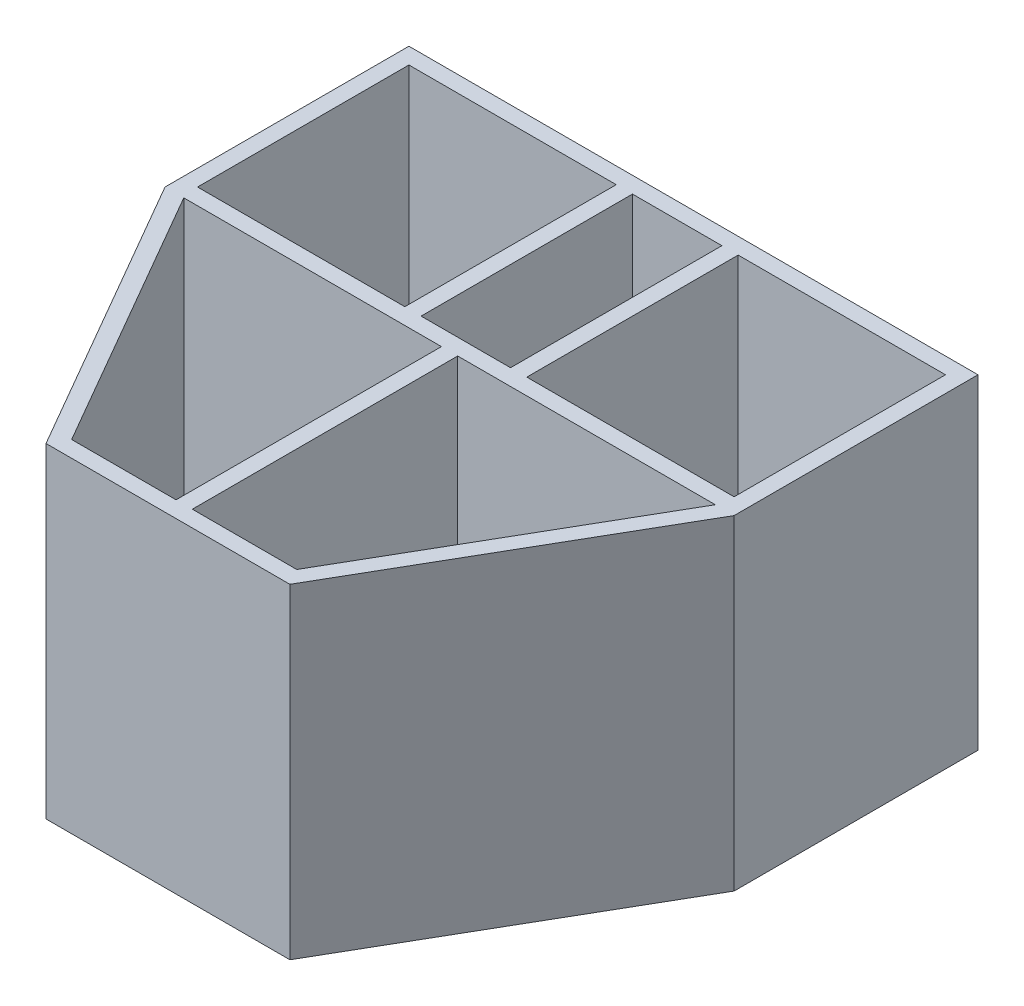
ISO-10303-21;
HEADER;
FILE_DESCRIPTION(('STEP AP214'),'2;1');
FILE_NAME('part.step','',(''),(''),'','','');
FILE_SCHEMA(('AUTOMOTIVE_DESIGN { 1 0 10303 214 1 1 1 1 }'));
ENDSEC;
DATA;
#1=APPLICATION_CONTEXT('core data for automotive mechanical design processes');
#2=APPLICATION_PROTOCOL_DEFINITION('international standard','automotive_design',2000,#1);
#3=PRODUCT_CONTEXT('',#1,'mechanical');
#4=PRODUCT('Part','Part','',(#3));
#5=PRODUCT_RELATED_PRODUCT_CATEGORY('part','',(#4));
#6=PRODUCT_DEFINITION_FORMATION('','',#4);
#7=PRODUCT_DEFINITION_CONTEXT('part definition',#1,'design');
#8=PRODUCT_DEFINITION('design','',#6,#7);
#9=PRODUCT_DEFINITION_SHAPE('','',#8);
#10=(LENGTH_UNIT() NAMED_UNIT(*) SI_UNIT(.MILLI.,.METRE.));
#11=(NAMED_UNIT(*) PLANE_ANGLE_UNIT() SI_UNIT($,.RADIAN.));
#12=(NAMED_UNIT(*) SI_UNIT($,.STERADIAN.) SOLID_ANGLE_UNIT());
#13=UNCERTAINTY_MEASURE_WITH_UNIT(LENGTH_MEASURE(1.E-05),#10,'distance_accuracy_value','');
#14=(GEOMETRIC_REPRESENTATION_CONTEXT(3) GLOBAL_UNCERTAINTY_ASSIGNED_CONTEXT((#13)) GLOBAL_UNIT_ASSIGNED_CONTEXT((#10,
#11,#12)) REPRESENTATION_CONTEXT('',''));
#15=CARTESIAN_POINT('',(0.,0.,0.));
#16=DIRECTION('',(0.,0.,1.));
#17=DIRECTION('',(1.,0.,0.));
#18=AXIS2_PLACEMENT_3D('',#15,#16,#17);
#19=CARTESIAN_POINT('',(0.,20.,0.));
#20=DIRECTION('',(0.,-1.,0.));
#21=DIRECTION('',(0.,0.,-1.));
#22=AXIS2_PLACEMENT_3D('',#19,#20,#21);
#23=PLANE('',#22);
#24=DIRECTION('',(-1.,0.,0.));
#25=VECTOR('',#24,1.);
#26=CARTESIAN_POINT('',(16.3452994616207,20.,0.));
#27=LINE('',#26,#25);
#28=CARTESIAN_POINT('',(16.3452994616207,20.,0.));
#29=VERTEX_POINT('',#28);
#30=CARTESIAN_POINT('',(0.500000000000004,20.,0.));
#31=VERTEX_POINT('',#30);
#32=EDGE_CURVE('E241',#29,#31,#27,.T.);
#33=ORIENTED_EDGE('',*,*,#32,.F.);
#34=DIRECTION('',(0.499999999999998,0.,-0.86602540378444));
#35=VECTOR('',#34,1.);
#36=CARTESIAN_POINT('',(6.92264973081037,20.,16.3205080756889));
#37=LINE('',#36,#35);
#38=CARTESIAN_POINT('',(6.92264973081037,20.,16.3205080756889));
#39=VERTEX_POINT('',#38);
#40=EDGE_CURVE('E249',#39,#29,#37,.T.);
#41=ORIENTED_EDGE('',*,*,#40,.F.);
#42=DIRECTION('',(1.,0.,0.));
#43=VECTOR('',#42,1.);
#44=CARTESIAN_POINT('',(0.500000000000006,20.,16.3205080756889));
#45=LINE('',#44,#43);
#46=CARTESIAN_POINT('',(0.500000000000006,20.,16.3205080756889));
#47=VERTEX_POINT('',#46);
#48=EDGE_CURVE('E246',#47,#39,#45,.T.);
#49=ORIENTED_EDGE('',*,*,#48,.F.);
#50=DIRECTION('',(0.,0.,1.));
#51=VECTOR('',#50,1.);
#52=CARTESIAN_POINT('',(0.500000000000004,20.,0.));
#53=LINE('',#52,#51);
#54=EDGE_CURVE('E243',#31,#47,#53,.T.);
#55=ORIENTED_EDGE('',*,*,#54,.F.);
#56=EDGE_LOOP('',(#33,#41,#49,#55));
#57=FACE_BOUND('',#56,.T.);
#58=DIRECTION('',(1.,0.,0.));
#59=VECTOR('',#58,1.);
#60=CARTESIAN_POINT('',(3.75,20.,-0.999999999999992));
#61=LINE('',#60,#59);
#62=CARTESIAN_POINT('',(3.75,20.,-0.999999999999992));
#63=VERTEX_POINT('',#62);
#64=CARTESIAN_POINT('',(16.5,20.,-0.999999999999992));
#65=VERTEX_POINT('',#64);
#66=EDGE_CURVE('E303',#63,#65,#61,.T.);
#67=ORIENTED_EDGE('',*,*,#66,.F.);
#68=DIRECTION('',(0.,0.,1.));
#69=VECTOR('',#68,1.);
#70=CARTESIAN_POINT('',(3.75,20.,-14.));
#71=LINE('',#70,#69);
#72=CARTESIAN_POINT('',(3.75,20.,-14.));
#73=VERTEX_POINT('',#72);
#74=EDGE_CURVE('E311',#73,#63,#71,.T.);
#75=ORIENTED_EDGE('',*,*,#74,.F.);
#76=DIRECTION('',(-1.,0.,0.));
#77=VECTOR('',#76,1.);
#78=CARTESIAN_POINT('',(3.75,20.,-14.));
#79=LINE('',#78,#77);
#80=CARTESIAN_POINT('',(16.5,20.,-14.));
#81=VERTEX_POINT('',#80);
#82=EDGE_CURVE('E308',#81,#73,#79,.T.);
#83=ORIENTED_EDGE('',*,*,#82,.F.);
#84=DIRECTION('',(0.,0.,-1.));
#85=VECTOR('',#84,1.);
#86=CARTESIAN_POINT('',(16.5,20.,-14.));
#87=LINE('',#86,#85);
#88=EDGE_CURVE('E305',#65,#81,#87,.T.);
#89=ORIENTED_EDGE('',*,*,#88,.F.);
#90=EDGE_LOOP('',(#67,#75,#83,#89));
#91=FACE_BOUND('',#90,.T.);
#92=DIRECTION('',(0.,0.,1.));
#93=VECTOR('',#92,1.);
#94=CARTESIAN_POINT('',(-17.5,20.,0.));
#95=LINE('',#94,#93);
#96=CARTESIAN_POINT('',(-17.5,20.,-15.));
#97=VERTEX_POINT('',#96);
#98=CARTESIAN_POINT('',(-17.5,20.,0.));
#99=VERTEX_POINT('',#98);
#100=EDGE_CURVE('E365',#97,#99,#95,.T.);
#101=ORIENTED_EDGE('',*,*,#100,.T.);
#102=DIRECTION('',(0.499999999999998,0.,0.86602540378444));
#103=VECTOR('',#102,1.);
#104=CARTESIAN_POINT('',(-7.49999999999999,20.,17.3205080756889));
#105=LINE('',#104,#103);
#106=CARTESIAN_POINT('',(-7.49999999999999,20.,17.3205080756889));
#107=VERTEX_POINT('',#106);
#108=EDGE_CURVE('E368',#99,#107,#105,.T.);
#109=ORIENTED_EDGE('',*,*,#108,.T.);
#110=DIRECTION('',(1.,0.,0.));
#111=VECTOR('',#110,1.);
#112=CARTESIAN_POINT('',(7.50000000000001,20.,17.3205080756889));
#113=LINE('',#112,#111);
#114=CARTESIAN_POINT('',(7.50000000000001,20.,17.3205080756889));
#115=VERTEX_POINT('',#114);
#116=EDGE_CURVE('E371',#107,#115,#113,.T.);
#117=ORIENTED_EDGE('',*,*,#116,.T.);
#118=DIRECTION('',(0.499999999999998,0.,-0.86602540378444));
#119=VECTOR('',#118,1.);
#120=CARTESIAN_POINT('',(17.5,20.,0.));
#121=LINE('',#120,#119);
#122=CARTESIAN_POINT('',(17.5,20.,0.));
#123=VERTEX_POINT('',#122);
#124=EDGE_CURVE('E373',#115,#123,#121,.T.);
#125=ORIENTED_EDGE('',*,*,#124,.T.);
#126=DIRECTION('',(0.,0.,-1.));
#127=VECTOR('',#126,1.);
#128=CARTESIAN_POINT('',(17.5,20.,-15.));
#129=LINE('',#128,#127);
#130=CARTESIAN_POINT('',(17.5,20.,-15.));
#131=VERTEX_POINT('',#130);
#132=EDGE_CURVE('E375',#123,#131,#129,.T.);
#133=ORIENTED_EDGE('',*,*,#132,.T.);
#134=DIRECTION('',(-1.,0.,0.));
#135=VECTOR('',#134,1.);
#136=CARTESIAN_POINT('',(-17.5,20.,-15.));
#137=LINE('',#136,#135);
#138=EDGE_CURVE('E377',#131,#97,#137,.T.);
#139=ORIENTED_EDGE('',*,*,#138,.T.);
#140=EDGE_LOOP('',(#101,#109,#117,#125,#133,#139));
#141=FACE_BOUND('',#140,.T.);
#142=DIRECTION('',(0.,0.,1.));
#143=VECTOR('',#142,1.);
#144=CARTESIAN_POINT('',(-16.5,20.,-14.));
#145=LINE('',#144,#143);
#146=CARTESIAN_POINT('',(-16.5,20.,-14.));
#147=VERTEX_POINT('',#146);
#148=CARTESIAN_POINT('',(-16.5,20.,-0.999999999999992));
#149=VERTEX_POINT('',#148);
#150=EDGE_CURVE('E334',#147,#149,#145,.T.);
#151=ORIENTED_EDGE('',*,*,#150,.F.);
#152=DIRECTION('',(-1.,0.,0.));
#153=VECTOR('',#152,1.);
#154=CARTESIAN_POINT('',(-16.5,20.,-14.));
#155=LINE('',#154,#153);
#156=CARTESIAN_POINT('',(-3.75,20.,-14.));
#157=VERTEX_POINT('',#156);
#158=EDGE_CURVE('E342',#157,#147,#155,.T.);
#159=ORIENTED_EDGE('',*,*,#158,.F.);
#160=DIRECTION('',(0.,0.,-1.));
#161=VECTOR('',#160,1.);
#162=CARTESIAN_POINT('',(-3.75,20.,-14.));
#163=LINE('',#162,#161);
#164=CARTESIAN_POINT('',(-3.75,20.,-0.999999999999992));
#165=VERTEX_POINT('',#164);
#166=EDGE_CURVE('E339',#165,#157,#163,.T.);
#167=ORIENTED_EDGE('',*,*,#166,.F.);
#168=DIRECTION('',(1.,0.,0.));
#169=VECTOR('',#168,1.);
#170=CARTESIAN_POINT('',(-16.5,20.,-0.999999999999992));
#171=LINE('',#170,#169);
#172=EDGE_CURVE('E336',#149,#165,#171,.T.);
#173=ORIENTED_EDGE('',*,*,#172,.F.);
#174=EDGE_LOOP('',(#151,#159,#167,#173));
#175=FACE_BOUND('',#174,.T.);
#176=DIRECTION('',(-1.,0.,0.));
#177=VECTOR('',#176,1.);
#178=CARTESIAN_POINT('',(-0.499999999999997,20.,0.));
#179=LINE('',#178,#177);
#180=CARTESIAN_POINT('',(-0.499999999999997,20.,0.));
#181=VERTEX_POINT('',#180);
#182=CARTESIAN_POINT('',(-16.3452994616207,20.,0.));
#183=VERTEX_POINT('',#182);
#184=EDGE_CURVE('E272',#181,#183,#179,.T.);
#185=ORIENTED_EDGE('',*,*,#184,.F.);
#186=DIRECTION('',(0.,0.,-1.));
#187=VECTOR('',#186,1.);
#188=CARTESIAN_POINT('',(-0.499999999999994,20.,16.3205080756889));
#189=LINE('',#188,#187);
#190=CARTESIAN_POINT('',(-0.499999999999994,20.,16.3205080756889));
#191=VERTEX_POINT('',#190);
#192=EDGE_CURVE('E280',#191,#181,#189,.T.);
#193=ORIENTED_EDGE('',*,*,#192,.F.);
#194=DIRECTION('',(1.,0.,0.));
#195=VECTOR('',#194,1.);
#196=CARTESIAN_POINT('',(-6.92264973081036,20.,16.3205080756889));
#197=LINE('',#196,#195);
#198=CARTESIAN_POINT('',(-6.92264973081036,20.,16.3205080756889));
#199=VERTEX_POINT('',#198);
#200=EDGE_CURVE('E277',#199,#191,#197,.T.);
#201=ORIENTED_EDGE('',*,*,#200,.F.);
#202=DIRECTION('',(0.499999999999998,0.,0.86602540378444));
#203=VECTOR('',#202,1.);
#204=CARTESIAN_POINT('',(-16.3452994616207,20.,0.));
#205=LINE('',#204,#203);
#206=EDGE_CURVE('E274',#183,#199,#205,.T.);
#207=ORIENTED_EDGE('',*,*,#206,.F.);
#208=EDGE_LOOP('',(#185,#193,#201,#207));
#209=FACE_BOUND('',#208,.T.);
#210=DIRECTION('',(-1.,0.,0.));
#211=VECTOR('',#210,1.);
#212=CARTESIAN_POINT('',(-2.75,20.,-14.));
#213=LINE('',#212,#211);
#214=CARTESIAN_POINT('',(2.75,20.,-14.));
#215=VERTEX_POINT('',#214);
#216=CARTESIAN_POINT('',(-2.75,20.,-14.));
#217=VERTEX_POINT('',#216);
#218=EDGE_CURVE('E205',#215,#217,#213,.T.);
#219=ORIENTED_EDGE('',*,*,#218,.F.);
#220=DIRECTION('',(0.,0.,-1.));
#221=VECTOR('',#220,1.);
#222=CARTESIAN_POINT('',(2.75,20.,-14.));
#223=LINE('',#222,#221);
#224=CARTESIAN_POINT('',(2.75,20.,-0.999999999999993));
#225=VERTEX_POINT('',#224);
#226=EDGE_CURVE('E227',#225,#215,#223,.T.);
#227=ORIENTED_EDGE('',*,*,#226,.F.);
#228=DIRECTION('',(1.,0.,0.));
#229=VECTOR('',#228,1.);
#230=CARTESIAN_POINT('',(-2.75,20.,-0.999999999999992));
#231=LINE('',#230,#229);
#232=CARTESIAN_POINT('',(-2.75,20.,-0.999999999999992));
#233=VERTEX_POINT('',#232);
#234=EDGE_CURVE('E225',#233,#225,#231,.T.);
#235=ORIENTED_EDGE('',*,*,#234,.F.);
#236=DIRECTION('',(0.,0.,1.));
#237=VECTOR('',#236,1.);
#238=CARTESIAN_POINT('',(-2.75,20.,-14.));
#239=LINE('',#238,#237);
#240=EDGE_CURVE('E213',#217,#233,#239,.T.);
#241=ORIENTED_EDGE('',*,*,#240,.F.);
#242=EDGE_LOOP('',(#219,#227,#235,#241));
#243=FACE_BOUND('',#242,.T.);
#244=ADVANCED_FACE('F32',(#57,#91,#141,#175,#209,#243),#23,.F.);
#245=CARTESIAN_POINT('',(0.,0.,0.));
#246=DIRECTION('',(0.,-1.,0.));
#247=DIRECTION('',(0.,0.,-1.));
#248=AXIS2_PLACEMENT_3D('',#245,#246,#247);
#249=PLANE('',#248);
#250=DIRECTION('',(0.499999999999998,0.,-0.86602540378444));
#251=VECTOR('',#250,1.);
#252=CARTESIAN_POINT('',(6.92264973081037,0.,16.3205080756889));
#253=LINE('',#252,#251);
#254=CARTESIAN_POINT('',(6.92264973081037,0.,16.3205080756889));
#255=VERTEX_POINT('',#254);
#256=CARTESIAN_POINT('',(16.3452994616207,0.,0.));
#257=VERTEX_POINT('',#256);
#258=EDGE_CURVE('E244',#255,#257,#253,.T.);
#259=ORIENTED_EDGE('',*,*,#258,.T.);
#260=DIRECTION('',(-1.,0.,0.));
#261=VECTOR('',#260,1.);
#262=CARTESIAN_POINT('',(16.3452994616207,0.,0.));
#263=LINE('',#262,#261);
#264=CARTESIAN_POINT('',(0.500000000000004,0.,0.));
#265=VERTEX_POINT('',#264);
#266=EDGE_CURVE('E221',#257,#265,#263,.T.);
#267=ORIENTED_EDGE('',*,*,#266,.T.);
#268=DIRECTION('',(0.,0.,1.));
#269=VECTOR('',#268,1.);
#270=CARTESIAN_POINT('',(0.500000000000004,0.,0.));
#271=LINE('',#270,#269);
#272=CARTESIAN_POINT('',(0.500000000000006,0.,16.3205080756889));
#273=VERTEX_POINT('',#272);
#274=EDGE_CURVE('E254',#265,#273,#271,.T.);
#275=ORIENTED_EDGE('',*,*,#274,.T.);
#276=DIRECTION('',(1.,0.,0.));
#277=VECTOR('',#276,1.);
#278=CARTESIAN_POINT('',(0.500000000000006,0.,16.3205080756889));
#279=LINE('',#278,#277);
#280=EDGE_CURVE('E257',#273,#255,#279,.T.);
#281=ORIENTED_EDGE('',*,*,#280,.T.);
#282=EDGE_LOOP('',(#259,#267,#275,#281));
#283=FACE_BOUND('',#282,.T.);
#284=DIRECTION('',(0.,0.,1.));
#285=VECTOR('',#284,1.);
#286=CARTESIAN_POINT('',(3.75,0.,-14.));
#287=LINE('',#286,#285);
#288=CARTESIAN_POINT('',(3.75,0.,-14.));
#289=VERTEX_POINT('',#288);
#290=CARTESIAN_POINT('',(3.75,0.,-0.999999999999992));
#291=VERTEX_POINT('',#290);
#292=EDGE_CURVE('E306',#289,#291,#287,.T.);
#293=ORIENTED_EDGE('',*,*,#292,.T.);
#294=DIRECTION('',(1.,0.,0.));
#295=VECTOR('',#294,1.);
#296=CARTESIAN_POINT('',(3.75,0.,-0.999999999999992));
#297=LINE('',#296,#295);
#298=CARTESIAN_POINT('',(16.5,0.,-0.999999999999992));
#299=VERTEX_POINT('',#298);
#300=EDGE_CURVE('E302',#291,#299,#297,.T.);
#301=ORIENTED_EDGE('',*,*,#300,.T.);
#302=DIRECTION('',(0.,0.,-1.));
#303=VECTOR('',#302,1.);
#304=CARTESIAN_POINT('',(16.5,0.,-14.));
#305=LINE('',#304,#303);
#306=CARTESIAN_POINT('',(16.5,0.,-14.));
#307=VERTEX_POINT('',#306);
#308=EDGE_CURVE('E316',#299,#307,#305,.T.);
#309=ORIENTED_EDGE('',*,*,#308,.T.);
#310=DIRECTION('',(-1.,0.,0.));
#311=VECTOR('',#310,1.);
#312=CARTESIAN_POINT('',(3.75,0.,-14.));
#313=LINE('',#312,#311);
#314=EDGE_CURVE('E319',#307,#289,#313,.T.);
#315=ORIENTED_EDGE('',*,*,#314,.T.);
#316=EDGE_LOOP('',(#293,#301,#309,#315));
#317=FACE_BOUND('',#316,.T.);
#318=DIRECTION('',(0.,0.,1.));
#319=VECTOR('',#318,1.);
#320=CARTESIAN_POINT('',(-17.5,0.,0.));
#321=LINE('',#320,#319);
#322=CARTESIAN_POINT('',(-17.5,0.,-15.));
#323=VERTEX_POINT('',#322);
#324=CARTESIAN_POINT('',(-17.5,0.,0.));
#325=VERTEX_POINT('',#324);
#326=EDGE_CURVE('E364',#323,#325,#321,.T.);
#327=ORIENTED_EDGE('',*,*,#326,.F.);
#328=DIRECTION('',(-1.,0.,0.));
#329=VECTOR('',#328,1.);
#330=CARTESIAN_POINT('',(-17.5,0.,-15.));
#331=LINE('',#330,#329);
#332=CARTESIAN_POINT('',(17.5,0.,-15.));
#333=VERTEX_POINT('',#332);
#334=EDGE_CURVE('E369',#333,#323,#331,.T.);
#335=ORIENTED_EDGE('',*,*,#334,.F.);
#336=DIRECTION('',(0.,0.,-1.));
#337=VECTOR('',#336,1.);
#338=CARTESIAN_POINT('',(17.5,0.,-15.));
#339=LINE('',#338,#337);
#340=CARTESIAN_POINT('',(17.5,0.,0.));
#341=VERTEX_POINT('',#340);
#342=EDGE_CURVE('E388',#341,#333,#339,.T.);
#343=ORIENTED_EDGE('',*,*,#342,.F.);
#344=DIRECTION('',(0.499999999999998,0.,-0.86602540378444));
#345=VECTOR('',#344,1.);
#346=CARTESIAN_POINT('',(17.5,0.,0.));
#347=LINE('',#346,#345);
#348=CARTESIAN_POINT('',(7.50000000000001,0.,17.3205080756889));
#349=VERTEX_POINT('',#348);
#350=EDGE_CURVE('E386',#349,#341,#347,.T.);
#351=ORIENTED_EDGE('',*,*,#350,.F.);
#352=DIRECTION('',(1.,0.,0.));
#353=VECTOR('',#352,1.);
#354=CARTESIAN_POINT('',(7.50000000000001,0.,17.3205080756889));
#355=LINE('',#354,#353);
#356=CARTESIAN_POINT('',(-7.49999999999999,0.,17.3205080756889));
#357=VERTEX_POINT('',#356);
#358=EDGE_CURVE('E384',#357,#349,#355,.T.);
#359=ORIENTED_EDGE('',*,*,#358,.F.);
#360=DIRECTION('',(0.499999999999998,0.,0.86602540378444));
#361=VECTOR('',#360,1.);
#362=CARTESIAN_POINT('',(-7.49999999999999,0.,17.3205080756889));
#363=LINE('',#362,#361);
#364=EDGE_CURVE('E382',#325,#357,#363,.T.);
#365=ORIENTED_EDGE('',*,*,#364,.F.);
#366=EDGE_LOOP('',(#327,#335,#343,#351,#359,#365));
#367=FACE_BOUND('',#366,.T.);
#368=DIRECTION('',(-1.,0.,0.));
#369=VECTOR('',#368,1.);
#370=CARTESIAN_POINT('',(-16.5,0.,-14.));
#371=LINE('',#370,#369);
#372=CARTESIAN_POINT('',(-3.75,0.,-14.));
#373=VERTEX_POINT('',#372);
#374=CARTESIAN_POINT('',(-16.5,0.,-14.));
#375=VERTEX_POINT('',#374);
#376=EDGE_CURVE('E337',#373,#375,#371,.T.);
#377=ORIENTED_EDGE('',*,*,#376,.T.);
#378=DIRECTION('',(0.,0.,1.));
#379=VECTOR('',#378,1.);
#380=CARTESIAN_POINT('',(-16.5,0.,-14.));
#381=LINE('',#380,#379);
#382=CARTESIAN_POINT('',(-16.5,0.,-0.999999999999992));
#383=VERTEX_POINT('',#382);
#384=EDGE_CURVE('E333',#375,#383,#381,.T.);
#385=ORIENTED_EDGE('',*,*,#384,.T.);
#386=DIRECTION('',(1.,0.,0.));
#387=VECTOR('',#386,1.);
#388=CARTESIAN_POINT('',(-16.5,0.,-0.999999999999992));
#389=LINE('',#388,#387);
#390=CARTESIAN_POINT('',(-3.75,0.,-0.999999999999992));
#391=VERTEX_POINT('',#390);
#392=EDGE_CURVE('E347',#383,#391,#389,.T.);
#393=ORIENTED_EDGE('',*,*,#392,.T.);
#394=DIRECTION('',(0.,0.,-1.));
#395=VECTOR('',#394,1.);
#396=CARTESIAN_POINT('',(-3.75,0.,-14.));
#397=LINE('',#396,#395);
#398=EDGE_CURVE('E350',#391,#373,#397,.T.);
#399=ORIENTED_EDGE('',*,*,#398,.T.);
#400=EDGE_LOOP('',(#377,#385,#393,#399));
#401=FACE_BOUND('',#400,.T.);
#402=DIRECTION('',(0.,0.,-1.));
#403=VECTOR('',#402,1.);
#404=CARTESIAN_POINT('',(-0.499999999999994,0.,16.3205080756889));
#405=LINE('',#404,#403);
#406=CARTESIAN_POINT('',(-0.499999999999994,0.,16.3205080756889));
#407=VERTEX_POINT('',#406);
#408=CARTESIAN_POINT('',(-0.499999999999997,0.,0.));
#409=VERTEX_POINT('',#408);
#410=EDGE_CURVE('E275',#407,#409,#405,.T.);
#411=ORIENTED_EDGE('',*,*,#410,.T.);
#412=DIRECTION('',(-1.,0.,0.));
#413=VECTOR('',#412,1.);
#414=CARTESIAN_POINT('',(-0.499999999999997,0.,0.));
#415=LINE('',#414,#413);
#416=CARTESIAN_POINT('',(-16.3452994616207,0.,0.));
#417=VERTEX_POINT('',#416);
#418=EDGE_CURVE('E271',#409,#417,#415,.T.);
#419=ORIENTED_EDGE('',*,*,#418,.T.);
#420=DIRECTION('',(0.499999999999998,0.,0.86602540378444));
#421=VECTOR('',#420,1.);
#422=CARTESIAN_POINT('',(-16.3452994616207,0.,0.));
#423=LINE('',#422,#421);
#424=CARTESIAN_POINT('',(-6.92264973081036,0.,16.3205080756889));
#425=VERTEX_POINT('',#424);
#426=EDGE_CURVE('E285',#417,#425,#423,.T.);
#427=ORIENTED_EDGE('',*,*,#426,.T.);
#428=DIRECTION('',(1.,0.,0.));
#429=VECTOR('',#428,1.);
#430=CARTESIAN_POINT('',(-6.92264973081036,0.,16.3205080756889));
#431=LINE('',#430,#429);
#432=EDGE_CURVE('E288',#425,#407,#431,.T.);
#433=ORIENTED_EDGE('',*,*,#432,.T.);
#434=EDGE_LOOP('',(#411,#419,#427,#433));
#435=FACE_BOUND('',#434,.T.);
#436=DIRECTION('',(0.,0.,-1.));
#437=VECTOR('',#436,1.);
#438=CARTESIAN_POINT('',(2.75,0.,-14.));
#439=LINE('',#438,#437);
#440=CARTESIAN_POINT('',(2.75,0.,-0.999999999999993));
#441=VERTEX_POINT('',#440);
#442=CARTESIAN_POINT('',(2.75,0.,-14.));
#443=VERTEX_POINT('',#442);
#444=EDGE_CURVE('E214',#441,#443,#439,.T.);
#445=ORIENTED_EDGE('',*,*,#444,.T.);
#446=DIRECTION('',(-1.,0.,0.));
#447=VECTOR('',#446,1.);
#448=CARTESIAN_POINT('',(-2.75,0.,-14.));
#449=LINE('',#448,#447);
#450=CARTESIAN_POINT('',(-2.75,0.,-14.));
#451=VERTEX_POINT('',#450);
#452=EDGE_CURVE('E55',#443,#451,#449,.T.);
#453=ORIENTED_EDGE('',*,*,#452,.T.);
#454=DIRECTION('',(0.,0.,1.));
#455=VECTOR('',#454,1.);
#456=CARTESIAN_POINT('',(-2.75,0.,-14.));
#457=LINE('',#456,#455);
#458=CARTESIAN_POINT('',(-2.75,0.,-0.999999999999992));
#459=VERTEX_POINT('',#458);
#460=EDGE_CURVE('E220',#451,#459,#457,.T.);
#461=ORIENTED_EDGE('',*,*,#460,.T.);
#462=DIRECTION('',(1.,0.,0.));
#463=VECTOR('',#462,1.);
#464=CARTESIAN_POINT('',(-2.75,0.,-0.999999999999992));
#465=LINE('',#464,#463);
#466=EDGE_CURVE('E233',#459,#441,#465,.T.);
#467=ORIENTED_EDGE('',*,*,#466,.T.);
#468=EDGE_LOOP('',(#445,#453,#461,#467));
#469=FACE_BOUND('',#468,.T.);
#470=ADVANCED_FACE('F412',(#283,#317,#367,#401,#435,#469),#249,.T.);
#471=CARTESIAN_POINT('',(-17.5,20.,0.));
#472=DIRECTION('',(1.,0.,0.));
#473=DIRECTION('',(0.,0.,-1.));
#474=AXIS2_PLACEMENT_3D('',#471,#472,#473);
#475=PLANE('',#474);
#476=ORIENTED_EDGE('',*,*,#326,.T.);
#477=DIRECTION('',(0.,-1.,0.));
#478=VECTOR('',#477,1.);
#479=CARTESIAN_POINT('',(-17.5,20.,0.));
#480=LINE('',#479,#478);
#481=EDGE_CURVE('E11',#99,#325,#480,.T.);
#482=ORIENTED_EDGE('',*,*,#481,.F.);
#483=ORIENTED_EDGE('',*,*,#100,.F.);
#484=DIRECTION('',(0.,-1.,0.));
#485=VECTOR('',#484,1.);
#486=CARTESIAN_POINT('',(-17.5,20.,-15.));
#487=LINE('',#486,#485);
#488=EDGE_CURVE('E379',#97,#323,#487,.T.);
#489=ORIENTED_EDGE('',*,*,#488,.T.);
#490=EDGE_LOOP('',(#476,#482,#483,#489));
#491=FACE_BOUND('',#490,.T.);
#492=ADVANCED_FACE('F34',(#491),#475,.F.);
#493=CARTESIAN_POINT('',(-7.49999999999999,20.,17.3205080756889));
#494=DIRECTION('',(0.86602540378444,0.,-0.499999999999998));
#495=DIRECTION('',(-0.499999999999998,0.,-0.86602540378444));
#496=AXIS2_PLACEMENT_3D('',#493,#494,#495);
#497=PLANE('',#496);
#498=ORIENTED_EDGE('',*,*,#364,.T.);
#499=DIRECTION('',(0.,-1.,0.));
#500=VECTOR('',#499,1.);
#501=CARTESIAN_POINT('',(-7.49999999999999,20.,17.3205080756889));
#502=LINE('',#501,#500);
#503=EDGE_CURVE('E40',#107,#357,#502,.T.);
#504=ORIENTED_EDGE('',*,*,#503,.F.);
#505=ORIENTED_EDGE('',*,*,#108,.F.);
#506=ORIENTED_EDGE('',*,*,#481,.T.);
#507=EDGE_LOOP('',(#498,#504,#505,#506));
#508=FACE_BOUND('',#507,.T.);
#509=ADVANCED_FACE('F430',(#508),#497,.F.);
#510=CARTESIAN_POINT('',(7.50000000000001,20.,17.3205080756889));
#511=DIRECTION('',(0.,0.,-1.));
#512=DIRECTION('',(-1.,0.,0.));
#513=AXIS2_PLACEMENT_3D('',#510,#511,#512);
#514=PLANE('',#513);
#515=ORIENTED_EDGE('',*,*,#358,.T.);
#516=DIRECTION('',(0.,-1.,0.));
#517=VECTOR('',#516,1.);
#518=CARTESIAN_POINT('',(7.50000000000001,20.,17.3205080756889));
#519=LINE('',#518,#517);
#520=EDGE_CURVE('E399',#115,#349,#519,.T.);
#521=ORIENTED_EDGE('',*,*,#520,.F.);
#522=ORIENTED_EDGE('',*,*,#116,.F.);
#523=ORIENTED_EDGE('',*,*,#503,.T.);
#524=EDGE_LOOP('',(#515,#521,#522,#523));
#525=FACE_BOUND('',#524,.T.);
#526=ADVANCED_FACE('F406',(#525),#514,.F.);
#527=CARTESIAN_POINT('',(17.5,20.,0.));
#528=DIRECTION('',(-0.86602540378444,0.,-0.499999999999998));
#529=DIRECTION('',(-0.499999999999998,0.,0.86602540378444));
#530=AXIS2_PLACEMENT_3D('',#527,#528,#529);
#531=PLANE('',#530);
#532=ORIENTED_EDGE('',*,*,#350,.T.);
#533=DIRECTION('',(0.,-1.,0.));
#534=VECTOR('',#533,1.);
#535=CARTESIAN_POINT('',(17.5,20.,0.));
#536=LINE('',#535,#534);
#537=EDGE_CURVE('E396',#123,#341,#536,.T.);
#538=ORIENTED_EDGE('',*,*,#537,.F.);
#539=ORIENTED_EDGE('',*,*,#124,.F.);
#540=ORIENTED_EDGE('',*,*,#520,.T.);
#541=EDGE_LOOP('',(#532,#538,#539,#540));
#542=FACE_BOUND('',#541,.T.);
#543=ADVANCED_FACE('F418',(#542),#531,.F.);
#544=CARTESIAN_POINT('',(17.5,20.,-15.));
#545=DIRECTION('',(-1.,0.,0.));
#546=DIRECTION('',(0.,0.,1.));
#547=AXIS2_PLACEMENT_3D('',#544,#545,#546);
#548=PLANE('',#547);
#549=ORIENTED_EDGE('',*,*,#342,.T.);
#550=DIRECTION('',(0.,-1.,0.));
#551=VECTOR('',#550,1.);
#552=CARTESIAN_POINT('',(17.5,20.,-15.));
#553=LINE('',#552,#551);
#554=EDGE_CURVE('E393',#131,#333,#553,.T.);
#555=ORIENTED_EDGE('',*,*,#554,.F.);
#556=ORIENTED_EDGE('',*,*,#132,.F.);
#557=ORIENTED_EDGE('',*,*,#537,.T.);
#558=EDGE_LOOP('',(#549,#555,#556,#557));
#559=FACE_BOUND('',#558,.T.);
#560=ADVANCED_FACE('F422',(#559),#548,.F.);
#561=CARTESIAN_POINT('',(-17.5,20.,-15.));
#562=DIRECTION('',(0.,0.,1.));
#563=DIRECTION('',(1.,0.,0.));
#564=AXIS2_PLACEMENT_3D('',#561,#562,#563);
#565=PLANE('',#564);
#566=ORIENTED_EDGE('',*,*,#334,.T.);
#567=ORIENTED_EDGE('',*,*,#488,.F.);
#568=ORIENTED_EDGE('',*,*,#138,.F.);
#569=ORIENTED_EDGE('',*,*,#554,.T.);
#570=EDGE_LOOP('',(#566,#567,#568,#569));
#571=FACE_BOUND('',#570,.T.);
#572=ADVANCED_FACE('F433',(#571),#565,.F.);
#573=CARTESIAN_POINT('',(-16.5,20.,-14.));
#574=DIRECTION('',(1.,0.,0.));
#575=DIRECTION('',(0.,0.,-1.));
#576=AXIS2_PLACEMENT_3D('',#573,#574,#575);
#577=PLANE('',#576);
#578=ORIENTED_EDGE('',*,*,#384,.F.);
#579=DIRECTION('',(0.,-1.,0.));
#580=VECTOR('',#579,1.);
#581=CARTESIAN_POINT('',(-16.5,20.,-14.));
#582=LINE('',#581,#580);
#583=EDGE_CURVE('E344',#147,#375,#582,.T.);
#584=ORIENTED_EDGE('',*,*,#583,.F.);
#585=ORIENTED_EDGE('',*,*,#150,.T.);
#586=DIRECTION('',(0.,-1.,0.));
#587=VECTOR('',#586,1.);
#588=CARTESIAN_POINT('',(-16.5,20.,-0.999999999999992));
#589=LINE('',#588,#587);
#590=EDGE_CURVE('E361',#149,#383,#589,.T.);
#591=ORIENTED_EDGE('',*,*,#590,.T.);
#592=EDGE_LOOP('',(#578,#584,#585,#591));
#593=FACE_BOUND('',#592,.T.);
#594=ADVANCED_FACE('F435',(#593),#577,.T.);
#595=CARTESIAN_POINT('',(-16.5,20.,-0.999999999999992));
#596=DIRECTION('',(0.,0.,-1.));
#597=DIRECTION('',(-1.,0.,0.));
#598=AXIS2_PLACEMENT_3D('',#595,#596,#597);
#599=PLANE('',#598);
#600=ORIENTED_EDGE('',*,*,#392,.F.);
#601=ORIENTED_EDGE('',*,*,#590,.F.);
#602=ORIENTED_EDGE('',*,*,#172,.T.);
#603=DIRECTION('',(0.,-1.,0.));
#604=VECTOR('',#603,1.);
#605=CARTESIAN_POINT('',(-3.75,20.,-0.999999999999992));
#606=LINE('',#605,#604);
#607=EDGE_CURVE('E359',#165,#391,#606,.T.);
#608=ORIENTED_EDGE('',*,*,#607,.T.);
#609=EDGE_LOOP('',(#600,#601,#602,#608));
#610=FACE_BOUND('',#609,.T.);
#611=ADVANCED_FACE('F441',(#610),#599,.T.);
#612=CARTESIAN_POINT('',(-3.75,20.,-14.));
#613=DIRECTION('',(-1.,0.,0.));
#614=DIRECTION('',(0.,0.,1.));
#615=AXIS2_PLACEMENT_3D('',#612,#613,#614);
#616=PLANE('',#615);
#617=ORIENTED_EDGE('',*,*,#398,.F.);
#618=ORIENTED_EDGE('',*,*,#607,.F.);
#619=ORIENTED_EDGE('',*,*,#166,.T.);
#620=DIRECTION('',(0.,-1.,0.));
#621=VECTOR('',#620,1.);
#622=CARTESIAN_POINT('',(-3.75,20.,-14.));
#623=LINE('',#622,#621);
#624=EDGE_CURVE('E357',#157,#373,#623,.T.);
#625=ORIENTED_EDGE('',*,*,#624,.T.);
#626=EDGE_LOOP('',(#617,#618,#619,#625));
#627=FACE_BOUND('',#626,.T.);
#628=ADVANCED_FACE('F458',(#627),#616,.T.);
#629=CARTESIAN_POINT('',(-16.5,20.,-14.));
#630=DIRECTION('',(0.,0.,1.));
#631=DIRECTION('',(1.,0.,0.));
#632=AXIS2_PLACEMENT_3D('',#629,#630,#631);
#633=PLANE('',#632);
#634=ORIENTED_EDGE('',*,*,#376,.F.);
#635=ORIENTED_EDGE('',*,*,#624,.F.);
#636=ORIENTED_EDGE('',*,*,#158,.T.);
#637=ORIENTED_EDGE('',*,*,#583,.T.);
#638=EDGE_LOOP('',(#634,#635,#636,#637));
#639=FACE_BOUND('',#638,.T.);
#640=ADVANCED_FACE('F462',(#639),#633,.T.);
#641=CARTESIAN_POINT('',(3.75,20.,-0.999999999999992));
#642=DIRECTION('',(0.,0.,-1.));
#643=DIRECTION('',(-1.,0.,0.));
#644=AXIS2_PLACEMENT_3D('',#641,#642,#643);
#645=PLANE('',#644);
#646=ORIENTED_EDGE('',*,*,#300,.F.);
#647=DIRECTION('',(0.,-1.,0.));
#648=VECTOR('',#647,1.);
#649=CARTESIAN_POINT('',(3.75,20.,-0.999999999999992));
#650=LINE('',#649,#648);
#651=EDGE_CURVE('E313',#63,#291,#650,.T.);
#652=ORIENTED_EDGE('',*,*,#651,.F.);
#653=ORIENTED_EDGE('',*,*,#66,.T.);
#654=DIRECTION('',(0.,-1.,0.));
#655=VECTOR('',#654,1.);
#656=CARTESIAN_POINT('',(16.5,20.,-0.999999999999992));
#657=LINE('',#656,#655);
#658=EDGE_CURVE('E330',#65,#299,#657,.T.);
#659=ORIENTED_EDGE('',*,*,#658,.T.);
#660=EDGE_LOOP('',(#646,#652,#653,#659));
#661=FACE_BOUND('',#660,.T.);
#662=ADVANCED_FACE('F466',(#661),#645,.T.);
#663=CARTESIAN_POINT('',(16.5,20.,-14.));
#664=DIRECTION('',(-1.,0.,0.));
#665=DIRECTION('',(0.,0.,1.));
#666=AXIS2_PLACEMENT_3D('',#663,#664,#665);
#667=PLANE('',#666);
#668=ORIENTED_EDGE('',*,*,#308,.F.);
#669=ORIENTED_EDGE('',*,*,#658,.F.);
#670=ORIENTED_EDGE('',*,*,#88,.T.);
#671=DIRECTION('',(0.,-1.,0.));
#672=VECTOR('',#671,1.);
#673=CARTESIAN_POINT('',(16.5,20.,-14.));
#674=LINE('',#673,#672);
#675=EDGE_CURVE('E328',#81,#307,#674,.T.);
#676=ORIENTED_EDGE('',*,*,#675,.T.);
#677=EDGE_LOOP('',(#668,#669,#670,#676));
#678=FACE_BOUND('',#677,.T.);
#679=ADVANCED_FACE('F470',(#678),#667,.T.);
#680=CARTESIAN_POINT('',(3.75,20.,-14.));
#681=DIRECTION('',(0.,0.,1.));
#682=DIRECTION('',(1.,0.,0.));
#683=AXIS2_PLACEMENT_3D('',#680,#681,#682);
#684=PLANE('',#683);
#685=ORIENTED_EDGE('',*,*,#314,.F.);
#686=ORIENTED_EDGE('',*,*,#675,.F.);
#687=ORIENTED_EDGE('',*,*,#82,.T.);
#688=DIRECTION('',(0.,-1.,0.));
#689=VECTOR('',#688,1.);
#690=CARTESIAN_POINT('',(3.75,20.,-14.));
#691=LINE('',#690,#689);
#692=EDGE_CURVE('E326',#73,#289,#691,.T.);
#693=ORIENTED_EDGE('',*,*,#692,.T.);
#694=EDGE_LOOP('',(#685,#686,#687,#693));
#695=FACE_BOUND('',#694,.T.);
#696=ADVANCED_FACE('F474',(#695),#684,.T.);
#697=CARTESIAN_POINT('',(3.75,20.,-14.));
#698=DIRECTION('',(1.,0.,0.));
#699=DIRECTION('',(0.,0.,-1.));
#700=AXIS2_PLACEMENT_3D('',#697,#698,#699);
#701=PLANE('',#700);
#702=ORIENTED_EDGE('',*,*,#292,.F.);
#703=ORIENTED_EDGE('',*,*,#692,.F.);
#704=ORIENTED_EDGE('',*,*,#74,.T.);
#705=ORIENTED_EDGE('',*,*,#651,.T.);
#706=EDGE_LOOP('',(#702,#703,#704,#705));
#707=FACE_BOUND('',#706,.T.);
#708=ADVANCED_FACE('F478',(#707),#701,.T.);
#709=CARTESIAN_POINT('',(-0.499999999999997,20.,0.));
#710=DIRECTION('',(0.,0.,1.));
#711=DIRECTION('',(1.,0.,0.));
#712=AXIS2_PLACEMENT_3D('',#709,#710,#711);
#713=PLANE('',#712);
#714=ORIENTED_EDGE('',*,*,#418,.F.);
#715=DIRECTION('',(0.,-1.,0.));
#716=VECTOR('',#715,1.);
#717=CARTESIAN_POINT('',(-0.499999999999997,20.,0.));
#718=LINE('',#717,#716);
#719=EDGE_CURVE('E282',#181,#409,#718,.T.);
#720=ORIENTED_EDGE('',*,*,#719,.F.);
#721=ORIENTED_EDGE('',*,*,#184,.T.);
#722=DIRECTION('',(0.,-1.,0.));
#723=VECTOR('',#722,1.);
#724=CARTESIAN_POINT('',(-16.3452994616207,20.,0.));
#725=LINE('',#724,#723);
#726=EDGE_CURVE('E299',#183,#417,#725,.T.);
#727=ORIENTED_EDGE('',*,*,#726,.T.);
#728=EDGE_LOOP('',(#714,#720,#721,#727));
#729=FACE_BOUND('',#728,.T.);
#730=ADVANCED_FACE('F482',(#729),#713,.T.);
#731=CARTESIAN_POINT('',(-16.3452994616207,20.,0.));
#732=DIRECTION('',(0.86602540378444,0.,-0.499999999999998));
#733=DIRECTION('',(-0.499999999999998,0.,-0.86602540378444));
#734=AXIS2_PLACEMENT_3D('',#731,#732,#733);
#735=PLANE('',#734);
#736=ORIENTED_EDGE('',*,*,#426,.F.);
#737=ORIENTED_EDGE('',*,*,#726,.F.);
#738=ORIENTED_EDGE('',*,*,#206,.T.);
#739=DIRECTION('',(0.,-1.,0.));
#740=VECTOR('',#739,1.);
#741=CARTESIAN_POINT('',(-6.92264973081036,20.,16.3205080756889));
#742=LINE('',#741,#740);
#743=EDGE_CURVE('E297',#199,#425,#742,.T.);
#744=ORIENTED_EDGE('',*,*,#743,.T.);
#745=EDGE_LOOP('',(#736,#737,#738,#744));
#746=FACE_BOUND('',#745,.T.);
#747=ADVANCED_FACE('F486',(#746),#735,.T.);
#748=CARTESIAN_POINT('',(-6.92264973081036,20.,16.3205080756889));
#749=DIRECTION('',(0.,0.,-1.));
#750=DIRECTION('',(-1.,0.,0.));
#751=AXIS2_PLACEMENT_3D('',#748,#749,#750);
#752=PLANE('',#751);
#753=ORIENTED_EDGE('',*,*,#432,.F.);
#754=ORIENTED_EDGE('',*,*,#743,.F.);
#755=ORIENTED_EDGE('',*,*,#200,.T.);
#756=DIRECTION('',(0.,-1.,0.));
#757=VECTOR('',#756,1.);
#758=CARTESIAN_POINT('',(-0.499999999999994,20.,16.3205080756889));
#759=LINE('',#758,#757);
#760=EDGE_CURVE('E295',#191,#407,#759,.T.);
#761=ORIENTED_EDGE('',*,*,#760,.T.);
#762=EDGE_LOOP('',(#753,#754,#755,#761));
#763=FACE_BOUND('',#762,.T.);
#764=ADVANCED_FACE('F490',(#763),#752,.T.);
#765=CARTESIAN_POINT('',(-0.499999999999994,20.,16.3205080756889));
#766=DIRECTION('',(-1.,0.,0.));
#767=DIRECTION('',(0.,0.,1.));
#768=AXIS2_PLACEMENT_3D('',#765,#766,#767);
#769=PLANE('',#768);
#770=ORIENTED_EDGE('',*,*,#410,.F.);
#771=ORIENTED_EDGE('',*,*,#760,.F.);
#772=ORIENTED_EDGE('',*,*,#192,.T.);
#773=ORIENTED_EDGE('',*,*,#719,.T.);
#774=EDGE_LOOP('',(#770,#771,#772,#773));
#775=FACE_BOUND('',#774,.T.);
#776=ADVANCED_FACE('F494',(#775),#769,.T.);
#777=CARTESIAN_POINT('',(16.3452994616207,20.,0.));
#778=DIRECTION('',(0.,0.,1.));
#779=DIRECTION('',(1.,0.,0.));
#780=AXIS2_PLACEMENT_3D('',#777,#778,#779);
#781=PLANE('',#780);
#782=ORIENTED_EDGE('',*,*,#266,.F.);
#783=DIRECTION('',(0.,-1.,0.));
#784=VECTOR('',#783,1.);
#785=CARTESIAN_POINT('',(16.3452994616207,20.,0.));
#786=LINE('',#785,#784);
#787=EDGE_CURVE('E251',#29,#257,#786,.T.);
#788=ORIENTED_EDGE('',*,*,#787,.F.);
#789=ORIENTED_EDGE('',*,*,#32,.T.);
#790=DIRECTION('',(0.,-1.,0.));
#791=VECTOR('',#790,1.);
#792=CARTESIAN_POINT('',(0.500000000000004,20.,0.));
#793=LINE('',#792,#791);
#794=EDGE_CURVE('E268',#31,#265,#793,.T.);
#795=ORIENTED_EDGE('',*,*,#794,.T.);
#796=EDGE_LOOP('',(#782,#788,#789,#795));
#797=FACE_BOUND('',#796,.T.);
#798=ADVANCED_FACE('F498',(#797),#781,.T.);
#799=CARTESIAN_POINT('',(0.500000000000004,20.,0.));
#800=DIRECTION('',(1.,0.,0.));
#801=DIRECTION('',(0.,0.,-1.));
#802=AXIS2_PLACEMENT_3D('',#799,#800,#801);
#803=PLANE('',#802);
#804=ORIENTED_EDGE('',*,*,#274,.F.);
#805=ORIENTED_EDGE('',*,*,#794,.F.);
#806=ORIENTED_EDGE('',*,*,#54,.T.);
#807=DIRECTION('',(0.,-1.,0.));
#808=VECTOR('',#807,1.);
#809=CARTESIAN_POINT('',(0.500000000000006,20.,16.3205080756889));
#810=LINE('',#809,#808);
#811=EDGE_CURVE('E266',#47,#273,#810,.T.);
#812=ORIENTED_EDGE('',*,*,#811,.T.);
#813=EDGE_LOOP('',(#804,#805,#806,#812));
#814=FACE_BOUND('',#813,.T.);
#815=ADVANCED_FACE('F502',(#814),#803,.T.);
#816=CARTESIAN_POINT('',(0.500000000000006,20.,16.3205080756889));
#817=DIRECTION('',(0.,0.,-1.));
#818=DIRECTION('',(-1.,0.,0.));
#819=AXIS2_PLACEMENT_3D('',#816,#817,#818);
#820=PLANE('',#819);
#821=ORIENTED_EDGE('',*,*,#280,.F.);
#822=ORIENTED_EDGE('',*,*,#811,.F.);
#823=ORIENTED_EDGE('',*,*,#48,.T.);
#824=DIRECTION('',(0.,-1.,0.));
#825=VECTOR('',#824,1.);
#826=CARTESIAN_POINT('',(6.92264973081037,20.,16.3205080756889));
#827=LINE('',#826,#825);
#828=EDGE_CURVE('E264',#39,#255,#827,.T.);
#829=ORIENTED_EDGE('',*,*,#828,.T.);
#830=EDGE_LOOP('',(#821,#822,#823,#829));
#831=FACE_BOUND('',#830,.T.);
#832=ADVANCED_FACE('F506',(#831),#820,.T.);
#833=CARTESIAN_POINT('',(6.92264973081037,20.,16.3205080756889));
#834=DIRECTION('',(-0.86602540378444,0.,-0.499999999999998));
#835=DIRECTION('',(-0.499999999999998,0.,0.86602540378444));
#836=AXIS2_PLACEMENT_3D('',#833,#834,#835);
#837=PLANE('',#836);
#838=ORIENTED_EDGE('',*,*,#258,.F.);
#839=ORIENTED_EDGE('',*,*,#828,.F.);
#840=ORIENTED_EDGE('',*,*,#40,.T.);
#841=ORIENTED_EDGE('',*,*,#787,.T.);
#842=EDGE_LOOP('',(#838,#839,#840,#841));
#843=FACE_BOUND('',#842,.T.);
#844=ADVANCED_FACE('F510',(#843),#837,.T.);
#845=CARTESIAN_POINT('',(-2.75,20.,-14.));
#846=DIRECTION('',(0.,0.,1.));
#847=DIRECTION('',(1.,0.,0.));
#848=AXIS2_PLACEMENT_3D('',#845,#846,#847);
#849=PLANE('',#848);
#850=ORIENTED_EDGE('',*,*,#452,.F.);
#851=DIRECTION('',(0.,-1.,0.));
#852=VECTOR('',#851,1.);
#853=CARTESIAN_POINT('',(2.75,20.,-14.));
#854=LINE('',#853,#852);
#855=EDGE_CURVE('E209',#215,#443,#854,.T.);
#856=ORIENTED_EDGE('',*,*,#855,.F.);
#857=ORIENTED_EDGE('',*,*,#218,.T.);
#858=DIRECTION('',(0.,-1.,0.));
#859=VECTOR('',#858,1.);
#860=CARTESIAN_POINT('',(-2.75,20.,-14.));
#861=LINE('',#860,#859);
#862=EDGE_CURVE('E208',#217,#451,#861,.T.);
#863=ORIENTED_EDGE('',*,*,#862,.T.);
#864=EDGE_LOOP('',(#850,#856,#857,#863));
#865=FACE_BOUND('',#864,.T.);
#866=ADVANCED_FACE('F207',(#865),#849,.T.);
#867=CARTESIAN_POINT('',(-2.75,20.,-14.));
#868=DIRECTION('',(1.,0.,0.));
#869=DIRECTION('',(0.,0.,-1.));
#870=AXIS2_PLACEMENT_3D('',#867,#868,#869);
#871=PLANE('',#870);
#872=ORIENTED_EDGE('',*,*,#460,.F.);
#873=ORIENTED_EDGE('',*,*,#862,.F.);
#874=ORIENTED_EDGE('',*,*,#240,.T.);
#875=DIRECTION('',(0.,-1.,0.));
#876=VECTOR('',#875,1.);
#877=CARTESIAN_POINT('',(-2.75,20.,-0.999999999999992));
#878=LINE('',#877,#876);
#879=EDGE_CURVE('E222',#233,#459,#878,.T.);
#880=ORIENTED_EDGE('',*,*,#879,.T.);
#881=EDGE_LOOP('',(#872,#873,#874,#880));
#882=FACE_BOUND('',#881,.T.);
#883=ADVANCED_FACE('F217',(#882),#871,.T.);
#884=CARTESIAN_POINT('',(-2.75,20.,-0.999999999999992));
#885=DIRECTION('',(0.,0.,-1.));
#886=DIRECTION('',(-1.,0.,0.));
#887=AXIS2_PLACEMENT_3D('',#884,#885,#886);
#888=PLANE('',#887);
#889=ORIENTED_EDGE('',*,*,#466,.F.);
#890=ORIENTED_EDGE('',*,*,#879,.F.);
#891=ORIENTED_EDGE('',*,*,#234,.T.);
#892=DIRECTION('',(0.,-1.,0.));
#893=VECTOR('',#892,1.);
#894=CARTESIAN_POINT('',(2.75,20.,-0.999999999999993));
#895=LINE('',#894,#893);
#896=EDGE_CURVE('E47',#225,#441,#895,.T.);
#897=ORIENTED_EDGE('',*,*,#896,.T.);
#898=EDGE_LOOP('',(#889,#890,#891,#897));
#899=FACE_BOUND('',#898,.T.);
#900=ADVANCED_FACE('F519',(#899),#888,.T.);
#901=CARTESIAN_POINT('',(2.75,20.,-14.));
#902=DIRECTION('',(-1.,0.,0.));
#903=DIRECTION('',(0.,0.,1.));
#904=AXIS2_PLACEMENT_3D('',#901,#902,#903);
#905=PLANE('',#904);
#906=ORIENTED_EDGE('',*,*,#444,.F.);
#907=ORIENTED_EDGE('',*,*,#896,.F.);
#908=ORIENTED_EDGE('',*,*,#226,.T.);
#909=ORIENTED_EDGE('',*,*,#855,.T.);
#910=EDGE_LOOP('',(#906,#907,#908,#909));
#911=FACE_BOUND('',#910,.T.);
#912=ADVANCED_FACE('F522',(#911),#905,.T.);
#913=CLOSED_SHELL('',(#244,#470,#492,#509,#526,#543,#560,#572,#594,#611,#628,#640,#662,#679,
#696,#708,#730,#747,#764,#776,#798,#815,#832,#844,#866,#883,#900,#912));
#914=MANIFOLD_SOLID_BREP('B2',#913);
#915=ADVANCED_BREP_SHAPE_REPRESENTATION('',(#18,#914),#14);
#916=SHAPE_DEFINITION_REPRESENTATION(#9,#915);
ENDSEC;
END-ISO-10303-21;
